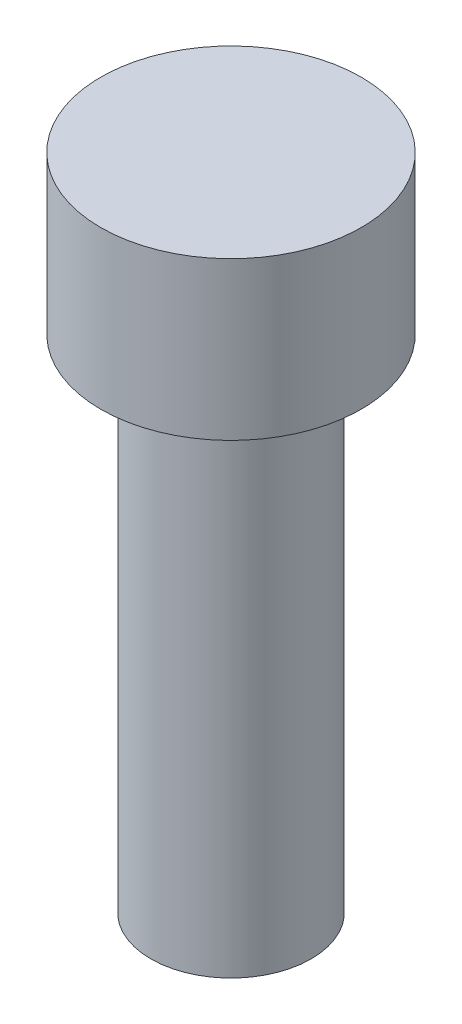
ISO-10303-21;
HEADER;
FILE_DESCRIPTION(('STEP AP214'),'2;1');
FILE_NAME('part.step','',(''),(''),'','','');
FILE_SCHEMA(('AUTOMOTIVE_DESIGN { 1 0 10303 214 1 1 1 1 }'));
ENDSEC;
DATA;
#1=APPLICATION_CONTEXT('core data for automotive mechanical design processes');
#2=APPLICATION_PROTOCOL_DEFINITION('international standard','automotive_design',2000,#1);
#3=PRODUCT_CONTEXT('',#1,'mechanical');
#4=PRODUCT('Part','Part','',(#3));
#5=PRODUCT_RELATED_PRODUCT_CATEGORY('part','',(#4));
#6=PRODUCT_DEFINITION_FORMATION('','',#4);
#7=PRODUCT_DEFINITION_CONTEXT('part definition',#1,'design');
#8=PRODUCT_DEFINITION('design','',#6,#7);
#9=PRODUCT_DEFINITION_SHAPE('','',#8);
#10=(LENGTH_UNIT() NAMED_UNIT(*) SI_UNIT(.MILLI.,.METRE.));
#11=(NAMED_UNIT(*) PLANE_ANGLE_UNIT() SI_UNIT($,.RADIAN.));
#12=(NAMED_UNIT(*) SI_UNIT($,.STERADIAN.) SOLID_ANGLE_UNIT());
#13=UNCERTAINTY_MEASURE_WITH_UNIT(LENGTH_MEASURE(1.E-05),#10,'distance_accuracy_value','');
#14=(GEOMETRIC_REPRESENTATION_CONTEXT(3) GLOBAL_UNCERTAINTY_ASSIGNED_CONTEXT((#13)) GLOBAL_UNIT_ASSIGNED_CONTEXT((#10,
#11,#12)) REPRESENTATION_CONTEXT('',''));
#15=CARTESIAN_POINT('',(0.,0.,0.));
#16=DIRECTION('',(0.,0.,1.));
#17=DIRECTION('',(1.,0.,0.));
#18=AXIS2_PLACEMENT_3D('',#15,#16,#17);
#19=CARTESIAN_POINT('',(0.,0.,0.));
#20=DIRECTION('',(0.,-1.,0.));
#21=DIRECTION('',(0.,0.,-1.));
#22=AXIS2_PLACEMENT_3D('',#19,#20,#21);
#23=PLANE('',#22);
#24=CARTESIAN_POINT('',(0.,0.,0.));
#25=DIRECTION('',(0.,1.,0.));
#26=DIRECTION('',(0.,0.,1.));
#27=AXIS2_PLACEMENT_3D('',#24,#25,#26);
#28=CIRCLE('',#27,6.5);
#29=CARTESIAN_POINT('',(0.,0.,6.5));
#30=VERTEX_POINT('',#29);
#31=EDGE_CURVE('E10',#30,#30,#28,.T.);
#32=ORIENTED_EDGE('',*,*,#31,.T.);
#33=EDGE_LOOP('',(#32));
#34=FACE_BOUND('',#33,.T.);
#35=ADVANCED_FACE('F28',(#34),#23,.F.);
#36=CARTESIAN_POINT('',(0.,0.,0.));
#37=DIRECTION('',(0.,1.,0.));
#38=DIRECTION('',(0.,0.,1.));
#39=AXIS2_PLACEMENT_3D('',#36,#37,#38);
#40=CYLINDRICAL_SURFACE('',#39,6.5);
#41=ORIENTED_EDGE('',*,*,#31,.F.);
#42=EDGE_LOOP('',(#41));
#43=FACE_BOUND('',#42,.T.);
#44=CARTESIAN_POINT('',(0.,-7.85210672201374,0.));
#45=DIRECTION('',(0.,1.,0.));
#46=DIRECTION('',(0.,0.,1.));
#47=AXIS2_PLACEMENT_3D('',#44,#45,#46);
#48=CIRCLE('',#47,6.5);
#49=CARTESIAN_POINT('',(0.,-7.85210672201374,6.5));
#50=VERTEX_POINT('',#49);
#51=EDGE_CURVE('E34',#50,#50,#48,.T.);
#52=ORIENTED_EDGE('',*,*,#51,.T.);
#53=EDGE_LOOP('',(#52));
#54=FACE_BOUND('',#53,.T.);
#55=ADVANCED_FACE('F60',(#43,#54),#40,.T.);
#56=CARTESIAN_POINT('',(6.5,-7.85210672201374,0.));
#57=DIRECTION('',(0.,1.,0.));
#58=DIRECTION('',(0.,0.,1.));
#59=AXIS2_PLACEMENT_3D('',#56,#57,#58);
#60=PLANE('',#59);
#61=ORIENTED_EDGE('',*,*,#51,.F.);
#62=EDGE_LOOP('',(#61));
#63=FACE_BOUND('',#62,.T.);
#64=CARTESIAN_POINT('',(0.,-7.85210672201374,0.));
#65=DIRECTION('',(0.,1.,0.));
#66=DIRECTION('',(0.,0.,1.));
#67=AXIS2_PLACEMENT_3D('',#64,#65,#66);
#68=CIRCLE('',#67,4.);
#69=CARTESIAN_POINT('',(0.,-7.85210672201374,4.));
#70=VERTEX_POINT('',#69);
#71=EDGE_CURVE('E38',#70,#70,#68,.T.);
#72=ORIENTED_EDGE('',*,*,#71,.T.);
#73=EDGE_LOOP('',(#72));
#74=FACE_BOUND('',#73,.T.);
#75=ADVANCED_FACE('F56',(#63,#74),#60,.F.);
#76=CARTESIAN_POINT('',(0.,0.,0.));
#77=DIRECTION('',(0.,1.,0.));
#78=DIRECTION('',(0.,0.,1.));
#79=AXIS2_PLACEMENT_3D('',#76,#77,#78);
#80=CYLINDRICAL_SURFACE('',#79,4.);
#81=ORIENTED_EDGE('',*,*,#71,.F.);
#82=EDGE_LOOP('',(#81));
#83=FACE_BOUND('',#82,.T.);
#84=CARTESIAN_POINT('',(0.,-32.8521067220137,0.));
#85=DIRECTION('',(0.,1.,0.));
#86=DIRECTION('',(0.,0.,1.));
#87=AXIS2_PLACEMENT_3D('',#84,#85,#86);
#88=CIRCLE('',#87,4.);
#89=CARTESIAN_POINT('',(0.,-32.8521067220137,4.));
#90=VERTEX_POINT('',#89);
#91=EDGE_CURVE('E42',#90,#90,#88,.T.);
#92=ORIENTED_EDGE('',*,*,#91,.T.);
#93=EDGE_LOOP('',(#92));
#94=FACE_BOUND('',#93,.T.);
#95=ADVANCED_FACE('F48',(#83,#94),#80,.T.);
#96=CARTESIAN_POINT('',(4.,-32.8521067220137,0.));
#97=DIRECTION('',(0.,1.,0.));
#98=DIRECTION('',(0.,0.,1.));
#99=AXIS2_PLACEMENT_3D('',#96,#97,#98);
#100=PLANE('',#99);
#101=ORIENTED_EDGE('',*,*,#91,.F.);
#102=EDGE_LOOP('',(#101));
#103=FACE_BOUND('',#102,.T.);
#104=ADVANCED_FACE('F50',(#103),#100,.F.);
#105=CLOSED_SHELL('',(#35,#55,#75,#95,#104));
#106=MANIFOLD_SOLID_BREP('B2',#105);
#107=ADVANCED_BREP_SHAPE_REPRESENTATION('',(#18,#106),#14);
#108=SHAPE_DEFINITION_REPRESENTATION(#9,#107);
ENDSEC;
END-ISO-10303-21;
